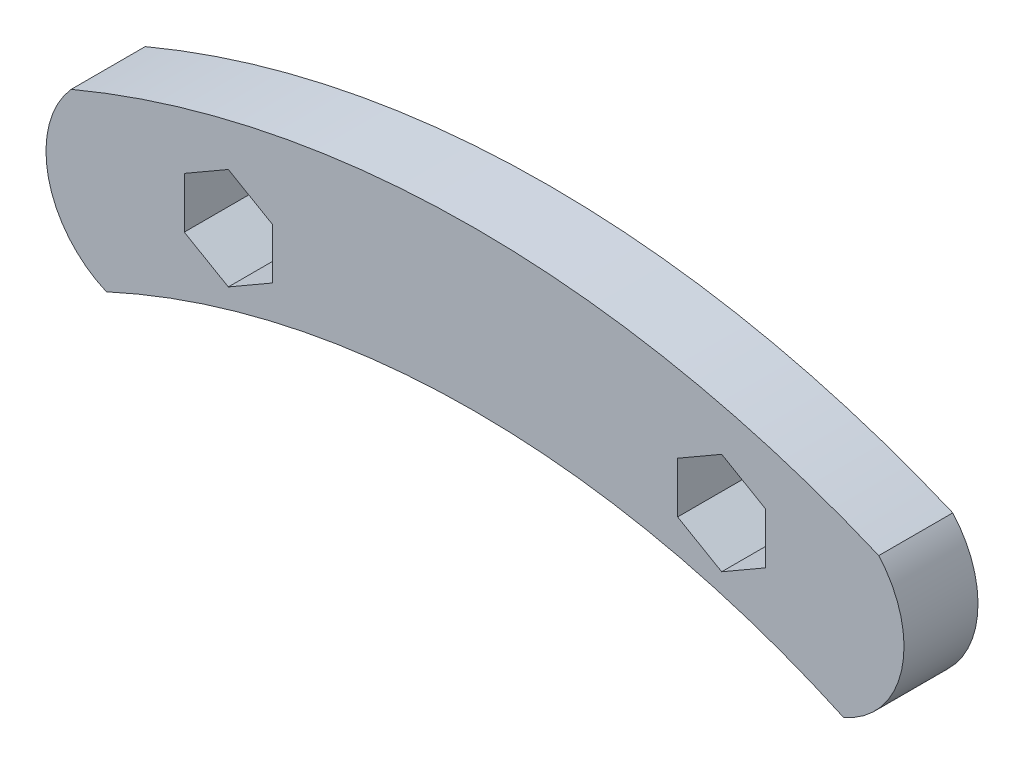
ISO-10303-21;
HEADER;
FILE_DESCRIPTION(('STEP AP214'),'2;1');
FILE_NAME('part.step','',(''),(''),'','','');
FILE_SCHEMA(('AUTOMOTIVE_DESIGN { 1 0 10303 214 1 1 1 1 }'));
ENDSEC;
DATA;
#1=APPLICATION_CONTEXT('core data for automotive mechanical design processes');
#2=APPLICATION_PROTOCOL_DEFINITION('international standard','automotive_design',2000,#1);
#3=PRODUCT_CONTEXT('',#1,'mechanical');
#4=PRODUCT('Part','Part','',(#3));
#5=PRODUCT_RELATED_PRODUCT_CATEGORY('part','',(#4));
#6=PRODUCT_DEFINITION_FORMATION('','',#4);
#7=PRODUCT_DEFINITION_CONTEXT('part definition',#1,'design');
#8=PRODUCT_DEFINITION('design','',#6,#7);
#9=PRODUCT_DEFINITION_SHAPE('','',#8);
#10=(LENGTH_UNIT() NAMED_UNIT(*) SI_UNIT(.MILLI.,.METRE.));
#11=(NAMED_UNIT(*) PLANE_ANGLE_UNIT() SI_UNIT($,.RADIAN.));
#12=(NAMED_UNIT(*) SI_UNIT($,.STERADIAN.) SOLID_ANGLE_UNIT());
#13=UNCERTAINTY_MEASURE_WITH_UNIT(LENGTH_MEASURE(1.E-05),#10,'distance_accuracy_value','');
#14=(GEOMETRIC_REPRESENTATION_CONTEXT(3) GLOBAL_UNCERTAINTY_ASSIGNED_CONTEXT((#13)) GLOBAL_UNIT_ASSIGNED_CONTEXT((#10,
#11,#12)) REPRESENTATION_CONTEXT('',''));
#15=CARTESIAN_POINT('',(0.,0.,0.));
#16=DIRECTION('',(0.,0.,1.));
#17=DIRECTION('',(1.,0.,0.));
#18=AXIS2_PLACEMENT_3D('',#15,#16,#17);
#19=CARTESIAN_POINT('',(-11.8743529349079,32.1369409329228,5.334));
#20=DIRECTION('',(0.,0.,1.));
#21=DIRECTION('',(1.,0.,0.));
#22=AXIS2_PLACEMENT_3D('',#19,#20,#21);
#23=PLANE('',#22);
#24=CARTESIAN_POINT('',(-23.7487058698158,64.2738818658455,5.334));
#25=DIRECTION('',(0.,0.,1.));
#26=DIRECTION('',(1.,0.,0.));
#27=AXIS2_PLACEMENT_3D('',#24,#25,#26);
#28=CIRCLE('',#27,7.17399122242576);
#29=CARTESIAN_POINT('',(-29.1049156924743,69.04642483528,5.334));
#30=VERTEX_POINT('',#29);
#31=CARTESIAN_POINT('',(-26.5655124405533,57.6760223036472,5.334));
#32=VERTEX_POINT('',#31);
#33=EDGE_CURVE('E241',#30,#32,#28,.T.);
#34=ORIENTED_EDGE('',*,*,#33,.T.);
#35=CARTESIAN_POINT('',(0.,0.,5.334));
#36=DIRECTION('',(0.,0.,-1.));
#37=DIRECTION('',(1.,0.,0.));
#38=AXIS2_PLACEMENT_3D('',#35,#36,#37);
#39=CIRCLE('',#38,63.5);
#40=CARTESIAN_POINT('',(26.5655124405533,57.6760223036472,5.334));
#41=VERTEX_POINT('',#40);
#42=EDGE_CURVE('E244',#32,#41,#39,.T.);
#43=ORIENTED_EDGE('',*,*,#42,.T.);
#44=CARTESIAN_POINT('',(23.7487058698158,64.2738818658455,5.334));
#45=DIRECTION('',(0.,0.,1.));
#46=DIRECTION('',(-1.,0.,0.));
#47=AXIS2_PLACEMENT_3D('',#44,#45,#46);
#48=CIRCLE('',#47,7.17399122242576);
#49=CARTESIAN_POINT('',(29.1049156924743,69.04642483528,5.334));
#50=VERTEX_POINT('',#49);
#51=EDGE_CURVE('E247',#41,#50,#48,.T.);
#52=ORIENTED_EDGE('',*,*,#51,.T.);
#53=CARTESIAN_POINT('',(0.,0.,5.334));
#54=DIRECTION('',(0.,0.,1.));
#55=DIRECTION('',(1.,0.,0.));
#56=AXIS2_PLACEMENT_3D('',#53,#54,#55);
#57=CIRCLE('',#56,74.93);
#58=EDGE_CURVE('E249',#50,#30,#57,.T.);
#59=ORIENTED_EDGE('',*,*,#58,.T.);
#60=EDGE_LOOP('',(#34,#43,#52,#59));
#61=FACE_BOUND('',#60,.T.);
#62=DIRECTION('',(0.866025403784438,0.5,0.));
#63=VECTOR('',#62,1.);
#64=CARTESIAN_POINT('',(-17.78,62.3738257906458,5.334));
#65=LINE('',#64,#63);
#66=CARTESIAN_POINT('',(-17.78,62.3738257906458,5.334));
#67=VERTEX_POINT('',#66);
#68=CARTESIAN_POINT('',(-14.605,64.2069128953229,5.334));
#69=VERTEX_POINT('',#68);
#70=EDGE_CURVE('E198',#67,#69,#65,.T.);
#71=ORIENTED_EDGE('',*,*,#70,.F.);
#72=DIRECTION('',(0.866025403784439,-0.5,0.));
#73=VECTOR('',#72,1.);
#74=CARTESIAN_POINT('',(-20.955,64.2069128953229,5.334));
#75=LINE('',#74,#73);
#76=CARTESIAN_POINT('',(-20.955,64.2069128953229,5.334));
#77=VERTEX_POINT('',#76);
#78=EDGE_CURVE('E196',#77,#67,#75,.T.);
#79=ORIENTED_EDGE('',*,*,#78,.F.);
#80=DIRECTION('',(0.,-1.,0.));
#81=VECTOR('',#80,1.);
#82=CARTESIAN_POINT('',(-20.955,67.873087104677,5.334));
#83=LINE('',#82,#81);
#84=CARTESIAN_POINT('',(-20.955,67.873087104677,5.334));
#85=VERTEX_POINT('',#84);
#86=EDGE_CURVE('E208',#85,#77,#83,.T.);
#87=ORIENTED_EDGE('',*,*,#86,.F.);
#88=DIRECTION('',(-0.866025403784438,-0.500000000000001,0.));
#89=VECTOR('',#88,1.);
#90=CARTESIAN_POINT('',(-17.78,69.7061742093541,5.334));
#91=LINE('',#90,#89);
#92=CARTESIAN_POINT('',(-17.78,69.7061742093541,5.334));
#93=VERTEX_POINT('',#92);
#94=EDGE_CURVE('E205',#93,#85,#91,.T.);
#95=ORIENTED_EDGE('',*,*,#94,.F.);
#96=DIRECTION('',(-0.866025403784439,0.499999999999999,0.));
#97=VECTOR('',#96,1.);
#98=CARTESIAN_POINT('',(-14.605,67.873087104677,5.334));
#99=LINE('',#98,#97);
#100=CARTESIAN_POINT('',(-14.605,67.873087104677,5.334));
#101=VERTEX_POINT('',#100);
#102=EDGE_CURVE('E203',#101,#93,#99,.T.);
#103=ORIENTED_EDGE('',*,*,#102,.F.);
#104=DIRECTION('',(0.,1.,0.));
#105=VECTOR('',#104,1.);
#106=CARTESIAN_POINT('',(-14.605,64.2069128953229,5.334));
#107=LINE('',#106,#105);
#108=EDGE_CURVE('E201',#69,#101,#107,.T.);
#109=ORIENTED_EDGE('',*,*,#108,.F.);
#110=EDGE_LOOP('',(#71,#79,#87,#95,#103,#109));
#111=FACE_BOUND('',#110,.T.);
#112=DIRECTION('',(0.866025403784438,0.500000000000001,0.));
#113=VECTOR('',#112,1.);
#114=CARTESIAN_POINT('',(17.78,62.3738257906458,5.334));
#115=LINE('',#114,#113);
#116=CARTESIAN_POINT('',(17.78,62.3738257906458,5.334));
#117=VERTEX_POINT('',#116);
#118=CARTESIAN_POINT('',(20.955,64.2069128953229,5.334));
#119=VERTEX_POINT('',#118);
#120=EDGE_CURVE('E153',#117,#119,#115,.T.);
#121=ORIENTED_EDGE('',*,*,#120,.F.);
#122=DIRECTION('',(0.866025403784438,-0.500000000000001,0.));
#123=VECTOR('',#122,1.);
#124=CARTESIAN_POINT('',(14.605,64.2069128953229,5.334));
#125=LINE('',#124,#123);
#126=CARTESIAN_POINT('',(14.605,64.2069128953229,5.334));
#127=VERTEX_POINT('',#126);
#128=EDGE_CURVE('E145',#127,#117,#125,.T.);
#129=ORIENTED_EDGE('',*,*,#128,.F.);
#130=DIRECTION('',(0.,-1.,0.));
#131=VECTOR('',#130,1.);
#132=CARTESIAN_POINT('',(14.605,67.873087104677,5.334));
#133=LINE('',#132,#131);
#134=CARTESIAN_POINT('',(14.605,67.873087104677,5.334));
#135=VERTEX_POINT('',#134);
#136=EDGE_CURVE('E174',#135,#127,#133,.T.);
#137=ORIENTED_EDGE('',*,*,#136,.F.);
#138=DIRECTION('',(-0.866025403784439,-0.5,0.));
#139=VECTOR('',#138,1.);
#140=CARTESIAN_POINT('',(17.78,69.7061742093541,5.334));
#141=LINE('',#140,#139);
#142=CARTESIAN_POINT('',(17.78,69.7061742093541,5.334));
#143=VERTEX_POINT('',#142);
#144=EDGE_CURVE('E172',#143,#135,#141,.T.);
#145=ORIENTED_EDGE('',*,*,#144,.F.);
#146=DIRECTION('',(-0.866025403784439,0.499999999999999,0.));
#147=VECTOR('',#146,1.);
#148=CARTESIAN_POINT('',(20.955,67.873087104677,5.334));
#149=LINE('',#148,#147);
#150=CARTESIAN_POINT('',(20.955,67.873087104677,5.334));
#151=VERTEX_POINT('',#150);
#152=EDGE_CURVE('E168',#151,#143,#149,.T.);
#153=ORIENTED_EDGE('',*,*,#152,.F.);
#154=DIRECTION('',(0.,1.,0.));
#155=VECTOR('',#154,1.);
#156=CARTESIAN_POINT('',(20.955,64.2069128953229,5.334));
#157=LINE('',#156,#155);
#158=EDGE_CURVE('E166',#119,#151,#157,.T.);
#159=ORIENTED_EDGE('',*,*,#158,.F.);
#160=EDGE_LOOP('',(#121,#129,#137,#145,#153,#159));
#161=FACE_BOUND('',#160,.T.);
#162=ADVANCED_FACE('F32',(#61,#111,#161),#23,.T.);
#163=CARTESIAN_POINT('',(-11.8743529349079,32.1369409329228,0.));
#164=DIRECTION('',(0.,0.,1.));
#165=DIRECTION('',(1.,0.,0.));
#166=AXIS2_PLACEMENT_3D('',#163,#164,#165);
#167=PLANE('',#166);
#168=DIRECTION('',(0.866025403784439,-0.5,0.));
#169=VECTOR('',#168,1.);
#170=CARTESIAN_POINT('',(-20.955,64.2069128953229,0.));
#171=LINE('',#170,#169);
#172=CARTESIAN_POINT('',(-20.955,64.2069128953229,0.));
#173=VERTEX_POINT('',#172);
#174=CARTESIAN_POINT('',(-17.78,62.3738257906458,0.));
#175=VERTEX_POINT('',#174);
#176=EDGE_CURVE('E161',#173,#175,#171,.T.);
#177=ORIENTED_EDGE('',*,*,#176,.T.);
#178=DIRECTION('',(0.866025403784438,0.5,0.));
#179=VECTOR('',#178,1.);
#180=CARTESIAN_POINT('',(-17.78,62.3738257906458,0.));
#181=LINE('',#180,#179);
#182=CARTESIAN_POINT('',(-14.605,64.2069128953229,0.));
#183=VERTEX_POINT('',#182);
#184=EDGE_CURVE('E213',#175,#183,#181,.T.);
#185=ORIENTED_EDGE('',*,*,#184,.T.);
#186=DIRECTION('',(0.,1.,0.));
#187=VECTOR('',#186,1.);
#188=CARTESIAN_POINT('',(-14.605,64.2069128953229,0.));
#189=LINE('',#188,#187);
#190=CARTESIAN_POINT('',(-14.605,67.873087104677,0.));
#191=VERTEX_POINT('',#190);
#192=EDGE_CURVE('E216',#183,#191,#189,.T.);
#193=ORIENTED_EDGE('',*,*,#192,.T.);
#194=DIRECTION('',(-0.866025403784439,0.499999999999999,0.));
#195=VECTOR('',#194,1.);
#196=CARTESIAN_POINT('',(-14.605,67.873087104677,0.));
#197=LINE('',#196,#195);
#198=CARTESIAN_POINT('',(-17.78,69.7061742093541,0.));
#199=VERTEX_POINT('',#198);
#200=EDGE_CURVE('E219',#191,#199,#197,.T.);
#201=ORIENTED_EDGE('',*,*,#200,.T.);
#202=DIRECTION('',(-0.866025403784438,-0.500000000000001,0.));
#203=VECTOR('',#202,1.);
#204=CARTESIAN_POINT('',(-17.78,69.7061742093541,0.));
#205=LINE('',#204,#203);
#206=CARTESIAN_POINT('',(-20.955,67.873087104677,0.));
#207=VERTEX_POINT('',#206);
#208=EDGE_CURVE('E222',#199,#207,#205,.T.);
#209=ORIENTED_EDGE('',*,*,#208,.T.);
#210=DIRECTION('',(0.,-1.,0.));
#211=VECTOR('',#210,1.);
#212=CARTESIAN_POINT('',(-20.955,67.873087104677,0.));
#213=LINE('',#212,#211);
#214=EDGE_CURVE('E199',#207,#173,#213,.T.);
#215=ORIENTED_EDGE('',*,*,#214,.T.);
#216=EDGE_LOOP('',(#177,#185,#193,#201,#209,#215));
#217=FACE_BOUND('',#216,.T.);
#218=CARTESIAN_POINT('',(-23.7487058698158,64.2738818658455,0.));
#219=DIRECTION('',(0.,0.,1.));
#220=DIRECTION('',(1.,0.,0.));
#221=AXIS2_PLACEMENT_3D('',#218,#219,#220);
#222=CIRCLE('',#221,7.17399122242576);
#223=CARTESIAN_POINT('',(-29.1049156924743,69.04642483528,0.));
#224=VERTEX_POINT('',#223);
#225=CARTESIAN_POINT('',(-26.5655124405533,57.6760223036472,0.));
#226=VERTEX_POINT('',#225);
#227=EDGE_CURVE('E240',#224,#226,#222,.T.);
#228=ORIENTED_EDGE('',*,*,#227,.F.);
#229=CARTESIAN_POINT('',(0.,0.,0.));
#230=DIRECTION('',(0.,0.,1.));
#231=DIRECTION('',(1.,0.,0.));
#232=AXIS2_PLACEMENT_3D('',#229,#230,#231);
#233=CIRCLE('',#232,74.93);
#234=CARTESIAN_POINT('',(29.1049156924743,69.04642483528,0.));
#235=VERTEX_POINT('',#234);
#236=EDGE_CURVE('E245',#235,#224,#233,.T.);
#237=ORIENTED_EDGE('',*,*,#236,.F.);
#238=CARTESIAN_POINT('',(23.7487058698158,64.2738818658455,0.));
#239=DIRECTION('',(0.,0.,1.));
#240=DIRECTION('',(-1.,0.,0.));
#241=AXIS2_PLACEMENT_3D('',#238,#239,#240);
#242=CIRCLE('',#241,7.17399122242576);
#243=CARTESIAN_POINT('',(26.5655124405533,57.6760223036472,0.));
#244=VERTEX_POINT('',#243);
#245=EDGE_CURVE('E256',#244,#235,#242,.T.);
#246=ORIENTED_EDGE('',*,*,#245,.F.);
#247=CARTESIAN_POINT('',(0.,0.,0.));
#248=DIRECTION('',(0.,0.,-1.));
#249=DIRECTION('',(1.,0.,0.));
#250=AXIS2_PLACEMENT_3D('',#247,#248,#249);
#251=CIRCLE('',#250,63.5);
#252=EDGE_CURVE('E254',#226,#244,#251,.T.);
#253=ORIENTED_EDGE('',*,*,#252,.F.);
#254=EDGE_LOOP('',(#228,#237,#246,#253));
#255=FACE_BOUND('',#254,.T.);
#256=DIRECTION('',(0.866025403784438,-0.500000000000001,0.));
#257=VECTOR('',#256,1.);
#258=CARTESIAN_POINT('',(14.605,64.2069128953229,0.));
#259=LINE('',#258,#257);
#260=CARTESIAN_POINT('',(14.605,64.2069128953229,0.));
#261=VERTEX_POINT('',#260);
#262=CARTESIAN_POINT('',(17.78,62.3738257906458,0.));
#263=VERTEX_POINT('',#262);
#264=EDGE_CURVE('E55',#261,#263,#259,.T.);
#265=ORIENTED_EDGE('',*,*,#264,.T.);
#266=DIRECTION('',(0.866025403784438,0.500000000000001,0.));
#267=VECTOR('',#266,1.);
#268=CARTESIAN_POINT('',(17.78,62.3738257906458,0.));
#269=LINE('',#268,#267);
#270=CARTESIAN_POINT('',(20.955,64.2069128953229,0.));
#271=VERTEX_POINT('',#270);
#272=EDGE_CURVE('E160',#263,#271,#269,.T.);
#273=ORIENTED_EDGE('',*,*,#272,.T.);
#274=DIRECTION('',(0.,1.,0.));
#275=VECTOR('',#274,1.);
#276=CARTESIAN_POINT('',(20.955,64.2069128953229,0.));
#277=LINE('',#276,#275);
#278=CARTESIAN_POINT('',(20.955,67.873087104677,0.));
#279=VERTEX_POINT('',#278);
#280=EDGE_CURVE('E178',#271,#279,#277,.T.);
#281=ORIENTED_EDGE('',*,*,#280,.T.);
#282=DIRECTION('',(-0.866025403784439,0.499999999999999,0.));
#283=VECTOR('',#282,1.);
#284=CARTESIAN_POINT('',(20.955,67.873087104677,0.));
#285=LINE('',#284,#283);
#286=CARTESIAN_POINT('',(17.78,69.7061742093541,0.));
#287=VERTEX_POINT('',#286);
#288=EDGE_CURVE('E181',#279,#287,#285,.T.);
#289=ORIENTED_EDGE('',*,*,#288,.T.);
#290=DIRECTION('',(-0.866025403784439,-0.5,0.));
#291=VECTOR('',#290,1.);
#292=CARTESIAN_POINT('',(17.78,69.7061742093541,0.));
#293=LINE('',#292,#291);
#294=CARTESIAN_POINT('',(14.605,67.873087104677,0.));
#295=VERTEX_POINT('',#294);
#296=EDGE_CURVE('E184',#287,#295,#293,.T.);
#297=ORIENTED_EDGE('',*,*,#296,.T.);
#298=DIRECTION('',(0.,-1.,0.));
#299=VECTOR('',#298,1.);
#300=CARTESIAN_POINT('',(14.605,67.873087104677,0.));
#301=LINE('',#300,#299);
#302=EDGE_CURVE('E154',#295,#261,#301,.T.);
#303=ORIENTED_EDGE('',*,*,#302,.T.);
#304=EDGE_LOOP('',(#265,#273,#281,#289,#297,#303));
#305=FACE_BOUND('',#304,.T.);
#306=ADVANCED_FACE('F274',(#217,#255,#305),#167,.F.);
#307=CARTESIAN_POINT('',(-23.7487058698158,64.2738818658455,5.334));
#308=DIRECTION('',(0.,0.,-1.));
#309=DIRECTION('',(-1.,0.,0.));
#310=AXIS2_PLACEMENT_3D('',#307,#308,#309);
#311=CYLINDRICAL_SURFACE('',#310,7.17399122242576);
#312=ORIENTED_EDGE('',*,*,#227,.T.);
#313=DIRECTION('',(0.,0.,-1.));
#314=VECTOR('',#313,1.);
#315=CARTESIAN_POINT('',(-26.5655124405533,57.6760223036472,5.334));
#316=LINE('',#315,#314);
#317=EDGE_CURVE('E11',#32,#226,#316,.T.);
#318=ORIENTED_EDGE('',*,*,#317,.F.);
#319=ORIENTED_EDGE('',*,*,#33,.F.);
#320=DIRECTION('',(0.,0.,-1.));
#321=VECTOR('',#320,1.);
#322=CARTESIAN_POINT('',(-29.1049156924743,69.04642483528,5.334));
#323=LINE('',#322,#321);
#324=EDGE_CURVE('E251',#30,#224,#323,.T.);
#325=ORIENTED_EDGE('',*,*,#324,.T.);
#326=EDGE_LOOP('',(#312,#318,#319,#325));
#327=FACE_BOUND('',#326,.T.);
#328=ADVANCED_FACE('F34',(#327),#311,.T.);
#329=CARTESIAN_POINT('',(0.,0.,5.334));
#330=DIRECTION('',(0.,0.,-1.));
#331=DIRECTION('',(-1.,0.,0.));
#332=AXIS2_PLACEMENT_3D('',#329,#330,#331);
#333=CYLINDRICAL_SURFACE('',#332,63.5);
#334=ORIENTED_EDGE('',*,*,#252,.T.);
#335=DIRECTION('',(0.,0.,-1.));
#336=VECTOR('',#335,1.);
#337=CARTESIAN_POINT('',(26.5655124405533,57.6760223036472,5.334));
#338=LINE('',#337,#336);
#339=EDGE_CURVE('E40',#41,#244,#338,.T.);
#340=ORIENTED_EDGE('',*,*,#339,.F.);
#341=ORIENTED_EDGE('',*,*,#42,.F.);
#342=ORIENTED_EDGE('',*,*,#317,.T.);
#343=EDGE_LOOP('',(#334,#340,#341,#342));
#344=FACE_BOUND('',#343,.T.);
#345=ADVANCED_FACE('F285',(#344),#333,.F.);
#346=CARTESIAN_POINT('',(23.7487058698158,64.2738818658455,5.334));
#347=DIRECTION('',(0.,0.,-1.));
#348=DIRECTION('',(-1.,0.,0.));
#349=AXIS2_PLACEMENT_3D('',#346,#347,#348);
#350=CYLINDRICAL_SURFACE('',#349,7.17399122242576);
#351=ORIENTED_EDGE('',*,*,#245,.T.);
#352=DIRECTION('',(0.,0.,-1.));
#353=VECTOR('',#352,1.);
#354=CARTESIAN_POINT('',(29.1049156924743,69.04642483528,5.334));
#355=LINE('',#354,#353);
#356=EDGE_CURVE('E261',#50,#235,#355,.T.);
#357=ORIENTED_EDGE('',*,*,#356,.F.);
#358=ORIENTED_EDGE('',*,*,#51,.F.);
#359=ORIENTED_EDGE('',*,*,#339,.T.);
#360=EDGE_LOOP('',(#351,#357,#358,#359));
#361=FACE_BOUND('',#360,.T.);
#362=ADVANCED_FACE('F268',(#361),#350,.T.);
#363=CARTESIAN_POINT('',(0.,0.,5.334));
#364=DIRECTION('',(0.,0.,-1.));
#365=DIRECTION('',(-1.,0.,0.));
#366=AXIS2_PLACEMENT_3D('',#363,#364,#365);
#367=CYLINDRICAL_SURFACE('',#366,74.93);
#368=ORIENTED_EDGE('',*,*,#236,.T.);
#369=ORIENTED_EDGE('',*,*,#324,.F.);
#370=ORIENTED_EDGE('',*,*,#58,.F.);
#371=ORIENTED_EDGE('',*,*,#356,.T.);
#372=EDGE_LOOP('',(#368,#369,#370,#371));
#373=FACE_BOUND('',#372,.T.);
#374=ADVANCED_FACE('F278',(#373),#367,.T.);
#375=CARTESIAN_POINT('',(-20.955,64.2069128953229,5.334));
#376=DIRECTION('',(0.5,0.866025403784439,0.));
#377=DIRECTION('',(-0.866025403784439,0.5,0.));
#378=AXIS2_PLACEMENT_3D('',#375,#376,#377);
#379=PLANE('',#378);
#380=ORIENTED_EDGE('',*,*,#176,.F.);
#381=DIRECTION('',(0.,0.,-1.));
#382=VECTOR('',#381,1.);
#383=CARTESIAN_POINT('',(-20.955,64.2069128953229,5.334));
#384=LINE('',#383,#382);
#385=EDGE_CURVE('E210',#77,#173,#384,.T.);
#386=ORIENTED_EDGE('',*,*,#385,.F.);
#387=ORIENTED_EDGE('',*,*,#78,.T.);
#388=DIRECTION('',(0.,0.,-1.));
#389=VECTOR('',#388,1.);
#390=CARTESIAN_POINT('',(-17.78,62.3738257906458,5.334));
#391=LINE('',#390,#389);
#392=EDGE_CURVE('E237',#67,#175,#391,.T.);
#393=ORIENTED_EDGE('',*,*,#392,.T.);
#394=EDGE_LOOP('',(#380,#386,#387,#393));
#395=FACE_BOUND('',#394,.T.);
#396=ADVANCED_FACE('F300',(#395),#379,.T.);
#397=CARTESIAN_POINT('',(-17.78,62.3738257906458,5.334));
#398=DIRECTION('',(-0.5,0.866025403784438,0.));
#399=DIRECTION('',(-0.866025403784438,-0.5,0.));
#400=AXIS2_PLACEMENT_3D('',#397,#398,#399);
#401=PLANE('',#400);
#402=ORIENTED_EDGE('',*,*,#184,.F.);
#403=ORIENTED_EDGE('',*,*,#392,.F.);
#404=ORIENTED_EDGE('',*,*,#70,.T.);
#405=DIRECTION('',(0.,0.,-1.));
#406=VECTOR('',#405,1.);
#407=CARTESIAN_POINT('',(-14.605,64.2069128953229,5.334));
#408=LINE('',#407,#406);
#409=EDGE_CURVE('E235',#69,#183,#408,.T.);
#410=ORIENTED_EDGE('',*,*,#409,.T.);
#411=EDGE_LOOP('',(#402,#403,#404,#410));
#412=FACE_BOUND('',#411,.T.);
#413=ADVANCED_FACE('F307',(#412),#401,.T.);
#414=CARTESIAN_POINT('',(-14.605,64.2069128953229,5.334));
#415=DIRECTION('',(-1.,0.,0.));
#416=DIRECTION('',(0.,-1.,0.));
#417=AXIS2_PLACEMENT_3D('',#414,#415,#416);
#418=PLANE('',#417);
#419=ORIENTED_EDGE('',*,*,#192,.F.);
#420=ORIENTED_EDGE('',*,*,#409,.F.);
#421=ORIENTED_EDGE('',*,*,#108,.T.);
#422=DIRECTION('',(0.,0.,-1.));
#423=VECTOR('',#422,1.);
#424=CARTESIAN_POINT('',(-14.605,67.873087104677,5.334));
#425=LINE('',#424,#423);
#426=EDGE_CURVE('E233',#101,#191,#425,.T.);
#427=ORIENTED_EDGE('',*,*,#426,.T.);
#428=EDGE_LOOP('',(#419,#420,#421,#427));
#429=FACE_BOUND('',#428,.T.);
#430=ADVANCED_FACE('F312',(#429),#418,.T.);
#431=CARTESIAN_POINT('',(-14.605,67.873087104677,5.334));
#432=DIRECTION('',(-0.499999999999999,-0.866025403784439,0.));
#433=DIRECTION('',(0.866025403784439,-0.499999999999999,0.));
#434=AXIS2_PLACEMENT_3D('',#431,#432,#433);
#435=PLANE('',#434);
#436=ORIENTED_EDGE('',*,*,#200,.F.);
#437=ORIENTED_EDGE('',*,*,#426,.F.);
#438=ORIENTED_EDGE('',*,*,#102,.T.);
#439=DIRECTION('',(0.,0.,-1.));
#440=VECTOR('',#439,1.);
#441=CARTESIAN_POINT('',(-17.78,69.7061742093541,5.334));
#442=LINE('',#441,#440);
#443=EDGE_CURVE('E231',#93,#199,#442,.T.);
#444=ORIENTED_EDGE('',*,*,#443,.T.);
#445=EDGE_LOOP('',(#436,#437,#438,#444));
#446=FACE_BOUND('',#445,.T.);
#447=ADVANCED_FACE('F335',(#446),#435,.T.);
#448=CARTESIAN_POINT('',(-17.78,69.7061742093541,5.334));
#449=DIRECTION('',(0.500000000000001,-0.866025403784438,0.));
#450=DIRECTION('',(0.866025403784438,0.500000000000001,0.));
#451=AXIS2_PLACEMENT_3D('',#448,#449,#450);
#452=PLANE('',#451);
#453=ORIENTED_EDGE('',*,*,#208,.F.);
#454=ORIENTED_EDGE('',*,*,#443,.F.);
#455=ORIENTED_EDGE('',*,*,#94,.T.);
#456=DIRECTION('',(0.,0.,-1.));
#457=VECTOR('',#456,1.);
#458=CARTESIAN_POINT('',(-20.955,67.873087104677,5.334));
#459=LINE('',#458,#457);
#460=EDGE_CURVE('E229',#85,#207,#459,.T.);
#461=ORIENTED_EDGE('',*,*,#460,.T.);
#462=EDGE_LOOP('',(#453,#454,#455,#461));
#463=FACE_BOUND('',#462,.T.);
#464=ADVANCED_FACE('F325',(#463),#452,.T.);
#465=CARTESIAN_POINT('',(-20.955,67.873087104677,5.334));
#466=DIRECTION('',(1.,0.,0.));
#467=DIRECTION('',(0.,0.,-1.));
#468=AXIS2_PLACEMENT_3D('',#465,#466,#467);
#469=PLANE('',#468);
#470=ORIENTED_EDGE('',*,*,#214,.F.);
#471=ORIENTED_EDGE('',*,*,#460,.F.);
#472=ORIENTED_EDGE('',*,*,#86,.T.);
#473=ORIENTED_EDGE('',*,*,#385,.T.);
#474=EDGE_LOOP('',(#470,#471,#472,#473));
#475=FACE_BOUND('',#474,.T.);
#476=ADVANCED_FACE('F319',(#475),#469,.T.);
#477=CARTESIAN_POINT('',(14.605,64.2069128953229,5.334));
#478=DIRECTION('',(0.500000000000001,0.866025403784438,0.));
#479=DIRECTION('',(-0.866025403784438,0.500000000000001,0.));
#480=AXIS2_PLACEMENT_3D('',#477,#478,#479);
#481=PLANE('',#480);
#482=ORIENTED_EDGE('',*,*,#264,.F.);
#483=DIRECTION('',(0.,0.,-1.));
#484=VECTOR('',#483,1.);
#485=CARTESIAN_POINT('',(14.605,64.2069128953229,5.334));
#486=LINE('',#485,#484);
#487=EDGE_CURVE('E149',#127,#261,#486,.T.);
#488=ORIENTED_EDGE('',*,*,#487,.F.);
#489=ORIENTED_EDGE('',*,*,#128,.T.);
#490=DIRECTION('',(0.,0.,-1.));
#491=VECTOR('',#490,1.);
#492=CARTESIAN_POINT('',(17.78,62.3738257906458,5.334));
#493=LINE('',#492,#491);
#494=EDGE_CURVE('E148',#117,#263,#493,.T.);
#495=ORIENTED_EDGE('',*,*,#494,.T.);
#496=EDGE_LOOP('',(#482,#488,#489,#495));
#497=FACE_BOUND('',#496,.T.);
#498=ADVANCED_FACE('F147',(#497),#481,.T.);
#499=CARTESIAN_POINT('',(17.78,62.3738257906458,5.334));
#500=DIRECTION('',(-0.500000000000001,0.866025403784438,0.));
#501=DIRECTION('',(-0.866025403784438,-0.500000000000001,0.));
#502=AXIS2_PLACEMENT_3D('',#499,#500,#501);
#503=PLANE('',#502);
#504=ORIENTED_EDGE('',*,*,#272,.F.);
#505=ORIENTED_EDGE('',*,*,#494,.F.);
#506=ORIENTED_EDGE('',*,*,#120,.T.);
#507=DIRECTION('',(0.,0.,-1.));
#508=VECTOR('',#507,1.);
#509=CARTESIAN_POINT('',(20.955,64.2069128953229,5.334));
#510=LINE('',#509,#508);
#511=EDGE_CURVE('E162',#119,#271,#510,.T.);
#512=ORIENTED_EDGE('',*,*,#511,.T.);
#513=EDGE_LOOP('',(#504,#505,#506,#512));
#514=FACE_BOUND('',#513,.T.);
#515=ADVANCED_FACE('F157',(#514),#503,.T.);
#516=CARTESIAN_POINT('',(20.955,64.2069128953229,5.334));
#517=DIRECTION('',(-1.,0.,0.));
#518=DIRECTION('',(0.,0.,1.));
#519=AXIS2_PLACEMENT_3D('',#516,#517,#518);
#520=PLANE('',#519);
#521=ORIENTED_EDGE('',*,*,#280,.F.);
#522=ORIENTED_EDGE('',*,*,#511,.F.);
#523=ORIENTED_EDGE('',*,*,#158,.T.);
#524=DIRECTION('',(0.,0.,-1.));
#525=VECTOR('',#524,1.);
#526=CARTESIAN_POINT('',(20.955,67.873087104677,5.334));
#527=LINE('',#526,#525);
#528=EDGE_CURVE('E193',#151,#279,#527,.T.);
#529=ORIENTED_EDGE('',*,*,#528,.T.);
#530=EDGE_LOOP('',(#521,#522,#523,#529));
#531=FACE_BOUND('',#530,.T.);
#532=ADVANCED_FACE('F351',(#531),#520,.T.);
#533=CARTESIAN_POINT('',(20.955,67.873087104677,5.334));
#534=DIRECTION('',(-0.5,-0.866025403784439,0.));
#535=DIRECTION('',(0.866025403784439,-0.5,0.));
#536=AXIS2_PLACEMENT_3D('',#533,#534,#535);
#537=PLANE('',#536);
#538=ORIENTED_EDGE('',*,*,#288,.F.);
#539=ORIENTED_EDGE('',*,*,#528,.F.);
#540=ORIENTED_EDGE('',*,*,#152,.T.);
#541=DIRECTION('',(0.,0.,-1.));
#542=VECTOR('',#541,1.);
#543=CARTESIAN_POINT('',(17.78,69.7061742093541,5.334));
#544=LINE('',#543,#542);
#545=EDGE_CURVE('E191',#143,#287,#544,.T.);
#546=ORIENTED_EDGE('',*,*,#545,.T.);
#547=EDGE_LOOP('',(#538,#539,#540,#546));
#548=FACE_BOUND('',#547,.T.);
#549=ADVANCED_FACE('F354',(#548),#537,.T.);
#550=CARTESIAN_POINT('',(17.78,69.7061742093541,5.334));
#551=DIRECTION('',(0.5,-0.866025403784439,0.));
#552=DIRECTION('',(0.866025403784439,0.5,0.));
#553=AXIS2_PLACEMENT_3D('',#550,#551,#552);
#554=PLANE('',#553);
#555=ORIENTED_EDGE('',*,*,#296,.F.);
#556=ORIENTED_EDGE('',*,*,#545,.F.);
#557=ORIENTED_EDGE('',*,*,#144,.T.);
#558=DIRECTION('',(0.,0.,-1.));
#559=VECTOR('',#558,1.);
#560=CARTESIAN_POINT('',(14.605,67.873087104677,5.334));
#561=LINE('',#560,#559);
#562=EDGE_CURVE('E47',#135,#295,#561,.T.);
#563=ORIENTED_EDGE('',*,*,#562,.T.);
#564=EDGE_LOOP('',(#555,#556,#557,#563));
#565=FACE_BOUND('',#564,.T.);
#566=ADVANCED_FACE('F358',(#565),#554,.T.);
#567=CARTESIAN_POINT('',(14.605,67.873087104677,5.334));
#568=DIRECTION('',(1.,0.,0.));
#569=DIRECTION('',(0.,0.,-1.));
#570=AXIS2_PLACEMENT_3D('',#567,#568,#569);
#571=PLANE('',#570);
#572=ORIENTED_EDGE('',*,*,#302,.F.);
#573=ORIENTED_EDGE('',*,*,#562,.F.);
#574=ORIENTED_EDGE('',*,*,#136,.T.);
#575=ORIENTED_EDGE('',*,*,#487,.T.);
#576=EDGE_LOOP('',(#572,#573,#574,#575));
#577=FACE_BOUND('',#576,.T.);
#578=ADVANCED_FACE('F362',(#577),#571,.T.);
#579=CLOSED_SHELL('',(#162,#306,#328,#345,#362,#374,#396,#413,#430,#447,#464,#476,#498,#515,
#532,#549,#566,#578));
#580=MANIFOLD_SOLID_BREP('B2',#579);
#581=ADVANCED_BREP_SHAPE_REPRESENTATION('',(#18,#580),#14);
#582=SHAPE_DEFINITION_REPRESENTATION(#9,#581);
ENDSEC;
END-ISO-10303-21;
